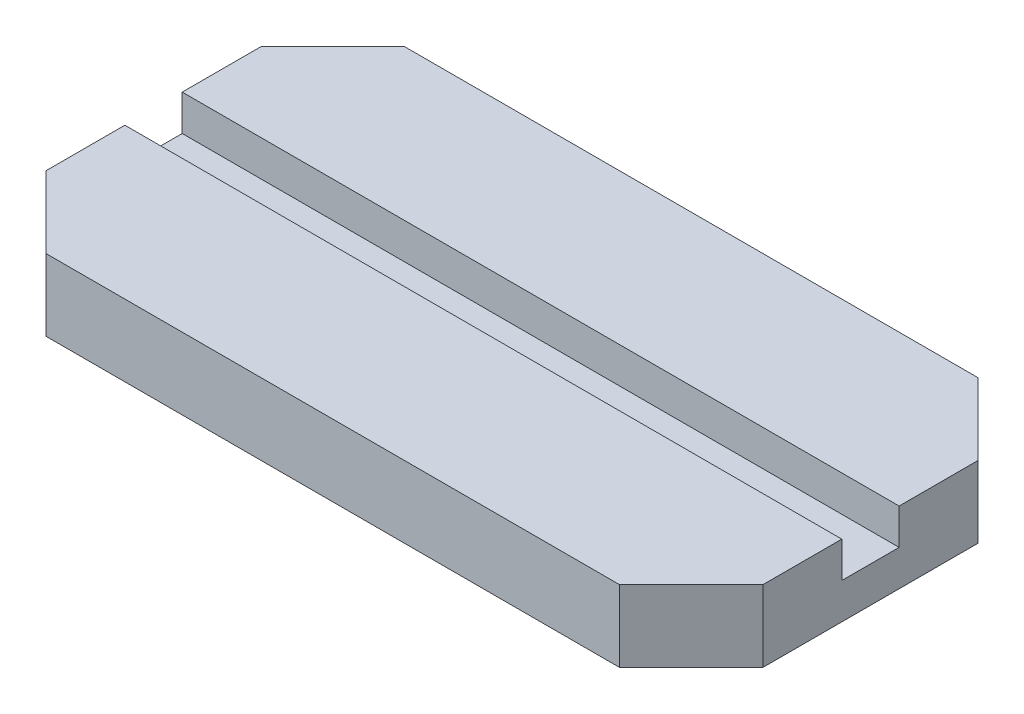
ISO-10303-21;
HEADER;
FILE_DESCRIPTION(('STEP AP214'),'2;1');
FILE_NAME('part.step','',(''),(''),'','','');
FILE_SCHEMA(('AUTOMOTIVE_DESIGN { 1 0 10303 214 1 1 1 1 }'));
ENDSEC;
DATA;
#1=APPLICATION_CONTEXT('core data for automotive mechanical design processes');
#2=APPLICATION_PROTOCOL_DEFINITION('international standard','automotive_design',2000,#1);
#3=PRODUCT_CONTEXT('',#1,'mechanical');
#4=PRODUCT('Part','Part','',(#3));
#5=PRODUCT_RELATED_PRODUCT_CATEGORY('part','',(#4));
#6=PRODUCT_DEFINITION_FORMATION('','',#4);
#7=PRODUCT_DEFINITION_CONTEXT('part definition',#1,'design');
#8=PRODUCT_DEFINITION('design','',#6,#7);
#9=PRODUCT_DEFINITION_SHAPE('','',#8);
#10=(LENGTH_UNIT() NAMED_UNIT(*) SI_UNIT(.MILLI.,.METRE.));
#11=(NAMED_UNIT(*) PLANE_ANGLE_UNIT() SI_UNIT($,.RADIAN.));
#12=(NAMED_UNIT(*) SI_UNIT($,.STERADIAN.) SOLID_ANGLE_UNIT());
#13=UNCERTAINTY_MEASURE_WITH_UNIT(LENGTH_MEASURE(1.E-05),#10,'distance_accuracy_value','');
#14=(GEOMETRIC_REPRESENTATION_CONTEXT(3) GLOBAL_UNCERTAINTY_ASSIGNED_CONTEXT((#13)) GLOBAL_UNIT_ASSIGNED_CONTEXT((#10,
#11,#12)) REPRESENTATION_CONTEXT('',''));
#15=CARTESIAN_POINT('',(0.,0.,0.));
#16=DIRECTION('',(0.,0.,1.));
#17=DIRECTION('',(1.,0.,0.));
#18=AXIS2_PLACEMENT_3D('',#15,#16,#17);
#19=CARTESIAN_POINT('',(0.,10.,0.));
#20=DIRECTION('',(0.,1.,0.));
#21=DIRECTION('',(0.,0.,1.));
#22=AXIS2_PLACEMENT_3D('',#19,#20,#21);
#23=PLANE('',#22);
#24=DIRECTION('',(-1.,0.,0.));
#25=VECTOR('',#24,1.);
#26=CARTESIAN_POINT('',(0.,10.,-4.));
#27=LINE('',#26,#25);
#28=CARTESIAN_POINT('',(50.,10.,-4.));
#29=VERTEX_POINT('',#28);
#30=CARTESIAN_POINT('',(-50.,10.,-4.));
#31=VERTEX_POINT('',#30);
#32=EDGE_CURVE('E55',#29,#31,#27,.T.);
#33=ORIENTED_EDGE('',*,*,#32,.F.);
#34=DIRECTION('',(0.,0.,-1.));
#35=VECTOR('',#34,1.);
#36=CARTESIAN_POINT('',(50.,10.,-25.));
#37=LINE('',#36,#35);
#38=CARTESIAN_POINT('',(50.,10.,-15.));
#39=VERTEX_POINT('',#38);
#40=EDGE_CURVE('E70',#29,#39,#37,.T.);
#41=ORIENTED_EDGE('',*,*,#40,.T.);
#42=DIRECTION('',(0.707106781186547,0.,0.707106781186549));
#43=VECTOR('',#42,1.);
#44=CARTESIAN_POINT('',(32.5,10.,-32.5));
#45=LINE('',#44,#43);
#46=CARTESIAN_POINT('',(40.,10.,-25.));
#47=VERTEX_POINT('',#46);
#48=EDGE_CURVE('E218',#39,#47,#45,.F.);
#49=ORIENTED_EDGE('',*,*,#48,.T.);
#50=DIRECTION('',(-1.,0.,0.));
#51=VECTOR('',#50,1.);
#52=CARTESIAN_POINT('',(-50.,10.,-25.));
#53=LINE('',#52,#51);
#54=CARTESIAN_POINT('',(-40.,10.,-25.));
#55=VERTEX_POINT('',#54);
#56=EDGE_CURVE('E161',#47,#55,#53,.T.);
#57=ORIENTED_EDGE('',*,*,#56,.T.);
#58=DIRECTION('',(0.707106781186549,0.,-0.707106781186547));
#59=VECTOR('',#58,1.);
#60=CARTESIAN_POINT('',(-32.4999999999999,10.,-32.5));
#61=LINE('',#60,#59);
#62=CARTESIAN_POINT('',(-50.,10.,-15.));
#63=VERTEX_POINT('',#62);
#64=EDGE_CURVE('E224',#55,#63,#61,.F.);
#65=ORIENTED_EDGE('',*,*,#64,.T.);
#66=DIRECTION('',(0.,0.,1.));
#67=VECTOR('',#66,1.);
#68=CARTESIAN_POINT('',(-50.,10.,-25.));
#69=LINE('',#68,#67);
#70=EDGE_CURVE('E251',#63,#31,#69,.T.);
#71=ORIENTED_EDGE('',*,*,#70,.T.);
#72=EDGE_LOOP('',(#33,#41,#49,#57,#65,#71));
#73=FACE_BOUND('',#72,.T.);
#74=ADVANCED_FACE('F45',(#73),#23,.T.);
#75=CARTESIAN_POINT('',(-50.,10.,-25.));
#76=DIRECTION('',(1.,0.,0.));
#77=DIRECTION('',(0.,0.,-1.));
#78=AXIS2_PLACEMENT_3D('',#75,#76,#77);
#79=PLANE('',#78);
#80=DIRECTION('',(0.,0.,1.));
#81=VECTOR('',#80,1.);
#82=CARTESIAN_POINT('',(-50.,5.,-25.));
#83=LINE('',#82,#81);
#84=CARTESIAN_POINT('',(-50.,5.,-4.));
#85=VERTEX_POINT('',#84);
#86=CARTESIAN_POINT('',(-50.,5.,4.));
#87=VERTEX_POINT('',#86);
#88=EDGE_CURVE('E177',#85,#87,#83,.T.);
#89=ORIENTED_EDGE('',*,*,#88,.F.);
#90=DIRECTION('',(0.,1.,0.));
#91=VECTOR('',#90,1.);
#92=CARTESIAN_POINT('',(-50.,10.,-4.));
#93=LINE('',#92,#91);
#94=EDGE_CURVE('E243',#85,#31,#93,.T.);
#95=ORIENTED_EDGE('',*,*,#94,.T.);
#96=ORIENTED_EDGE('',*,*,#70,.F.);
#97=DIRECTION('',(0.,-1.,0.));
#98=VECTOR('',#97,1.);
#99=CARTESIAN_POINT('',(-50.,10.,-15.));
#100=LINE('',#99,#98);
#101=CARTESIAN_POINT('',(-50.,0.,-15.));
#102=VERTEX_POINT('',#101);
#103=EDGE_CURVE('E193',#63,#102,#100,.T.);
#104=ORIENTED_EDGE('',*,*,#103,.T.);
#105=DIRECTION('',(0.,0.,1.));
#106=VECTOR('',#105,1.);
#107=CARTESIAN_POINT('',(-50.,0.,-25.));
#108=LINE('',#107,#106);
#109=CARTESIAN_POINT('',(-50.,0.,15.));
#110=VERTEX_POINT('',#109);
#111=EDGE_CURVE('E172',#102,#110,#108,.T.);
#112=ORIENTED_EDGE('',*,*,#111,.T.);
#113=DIRECTION('',(0.,1.,0.));
#114=VECTOR('',#113,1.);
#115=CARTESIAN_POINT('',(-50.,10.,15.));
#116=LINE('',#115,#114);
#117=CARTESIAN_POINT('',(-50.,10.,15.));
#118=VERTEX_POINT('',#117);
#119=EDGE_CURVE('E166',#110,#118,#116,.T.);
#120=ORIENTED_EDGE('',*,*,#119,.T.);
#121=CARTESIAN_POINT('',(-50.,10.,4.));
#122=VERTEX_POINT('',#121);
#123=EDGE_CURVE('E189',#122,#118,#69,.T.);
#124=ORIENTED_EDGE('',*,*,#123,.F.);
#125=DIRECTION('',(0.,-1.,0.));
#126=VECTOR('',#125,1.);
#127=CARTESIAN_POINT('',(-50.,10.,4.));
#128=LINE('',#127,#126);
#129=EDGE_CURVE('E62',#122,#87,#128,.T.);
#130=ORIENTED_EDGE('',*,*,#129,.T.);
#131=EDGE_LOOP('',(#89,#95,#96,#104,#112,#120,#124,#130));
#132=FACE_BOUND('',#131,.T.);
#133=ADVANCED_FACE('F250',(#132),#79,.F.);
#134=CARTESIAN_POINT('',(-50.,10.,25.));
#135=DIRECTION('',(0.,0.,-1.));
#136=DIRECTION('',(-1.,0.,0.));
#137=AXIS2_PLACEMENT_3D('',#134,#135,#136);
#138=PLANE('',#137);
#139=DIRECTION('',(1.,0.,0.));
#140=VECTOR('',#139,1.);
#141=CARTESIAN_POINT('',(-50.,10.,25.));
#142=LINE('',#141,#140);
#143=CARTESIAN_POINT('',(-40.,10.,25.));
#144=VERTEX_POINT('',#143);
#145=CARTESIAN_POINT('',(39.9999999999999,10.,25.));
#146=VERTEX_POINT('',#145);
#147=EDGE_CURVE('E168',#144,#146,#142,.T.);
#148=ORIENTED_EDGE('',*,*,#147,.F.);
#149=DIRECTION('',(0.,-1.,0.));
#150=VECTOR('',#149,1.);
#151=CARTESIAN_POINT('',(-40.,10.,25.));
#152=LINE('',#151,#150);
#153=CARTESIAN_POINT('',(-40.,0.,25.));
#154=VERTEX_POINT('',#153);
#155=EDGE_CURVE('E230',#144,#154,#152,.T.);
#156=ORIENTED_EDGE('',*,*,#155,.T.);
#157=DIRECTION('',(1.,0.,0.));
#158=VECTOR('',#157,1.);
#159=CARTESIAN_POINT('',(-50.,0.,25.));
#160=LINE('',#159,#158);
#161=CARTESIAN_POINT('',(39.9999999999999,0.,25.));
#162=VERTEX_POINT('',#161);
#163=EDGE_CURVE('E176',#154,#162,#160,.T.);
#164=ORIENTED_EDGE('',*,*,#163,.T.);
#165=DIRECTION('',(0.,1.,0.));
#166=VECTOR('',#165,1.);
#167=CARTESIAN_POINT('',(39.9999999999999,10.,25.));
#168=LINE('',#167,#166);
#169=EDGE_CURVE('E227',#162,#146,#168,.T.);
#170=ORIENTED_EDGE('',*,*,#169,.T.);
#171=EDGE_LOOP('',(#148,#156,#164,#170));
#172=FACE_BOUND('',#171,.T.);
#173=ADVANCED_FACE('F278',(#172),#138,.F.);
#174=CARTESIAN_POINT('',(50.,10.,-25.));
#175=DIRECTION('',(-1.,0.,0.));
#176=DIRECTION('',(0.,0.,1.));
#177=AXIS2_PLACEMENT_3D('',#174,#175,#176);
#178=PLANE('',#177);
#179=ORIENTED_EDGE('',*,*,#40,.F.);
#180=DIRECTION('',(0.,-1.,0.));
#181=VECTOR('',#180,1.);
#182=CARTESIAN_POINT('',(50.,10.,-4.));
#183=LINE('',#182,#181);
#184=CARTESIAN_POINT('',(50.,5.,-4.));
#185=VERTEX_POINT('',#184);
#186=EDGE_CURVE('E245',#29,#185,#183,.T.);
#187=ORIENTED_EDGE('',*,*,#186,.T.);
#188=DIRECTION('',(0.,0.,-1.));
#189=VECTOR('',#188,1.);
#190=CARTESIAN_POINT('',(50.,5.,-25.));
#191=LINE('',#190,#189);
#192=CARTESIAN_POINT('',(50.,5.,4.));
#193=VERTEX_POINT('',#192);
#194=EDGE_CURVE('E11',#193,#185,#191,.T.);
#195=ORIENTED_EDGE('',*,*,#194,.F.);
#196=DIRECTION('',(0.,1.,0.));
#197=VECTOR('',#196,1.);
#198=CARTESIAN_POINT('',(50.,10.,4.));
#199=LINE('',#198,#197);
#200=CARTESIAN_POINT('',(50.,10.,4.));
#201=VERTEX_POINT('',#200);
#202=EDGE_CURVE('E137',#193,#201,#199,.T.);
#203=ORIENTED_EDGE('',*,*,#202,.T.);
#204=CARTESIAN_POINT('',(50.,10.,15.));
#205=VERTEX_POINT('',#204);
#206=EDGE_CURVE('E150',#205,#201,#37,.T.);
#207=ORIENTED_EDGE('',*,*,#206,.F.);
#208=DIRECTION('',(0.,-1.,0.));
#209=VECTOR('',#208,1.);
#210=CARTESIAN_POINT('',(50.,10.,15.));
#211=LINE('',#210,#209);
#212=CARTESIAN_POINT('',(50.,0.,15.));
#213=VERTEX_POINT('',#212);
#214=EDGE_CURVE('E234',#205,#213,#211,.T.);
#215=ORIENTED_EDGE('',*,*,#214,.T.);
#216=DIRECTION('',(0.,0.,-1.));
#217=VECTOR('',#216,1.);
#218=CARTESIAN_POINT('',(50.,0.,-25.));
#219=LINE('',#218,#217);
#220=CARTESIAN_POINT('',(50.,0.,-15.));
#221=VERTEX_POINT('',#220);
#222=EDGE_CURVE('E181',#213,#221,#219,.T.);
#223=ORIENTED_EDGE('',*,*,#222,.T.);
#224=DIRECTION('',(0.,1.,0.));
#225=VECTOR('',#224,1.);
#226=CARTESIAN_POINT('',(50.,10.,-15.));
#227=LINE('',#226,#225);
#228=EDGE_CURVE('E143',#221,#39,#227,.T.);
#229=ORIENTED_EDGE('',*,*,#228,.T.);
#230=EDGE_LOOP('',(#179,#187,#195,#203,#207,#215,#223,#229));
#231=FACE_BOUND('',#230,.T.);
#232=ADVANCED_FACE('F148',(#231),#178,.F.);
#233=CARTESIAN_POINT('',(-50.,10.,-25.));
#234=DIRECTION('',(0.,0.,1.));
#235=DIRECTION('',(1.,0.,0.));
#236=AXIS2_PLACEMENT_3D('',#233,#234,#235);
#237=PLANE('',#236);
#238=DIRECTION('',(-1.,0.,0.));
#239=VECTOR('',#238,1.);
#240=CARTESIAN_POINT('',(-50.,0.,-25.));
#241=LINE('',#240,#239);
#242=CARTESIAN_POINT('',(40.,0.,-25.));
#243=VERTEX_POINT('',#242);
#244=CARTESIAN_POINT('',(-40.,0.,-25.));
#245=VERTEX_POINT('',#244);
#246=EDGE_CURVE('E185',#243,#245,#241,.T.);
#247=ORIENTED_EDGE('',*,*,#246,.T.);
#248=DIRECTION('',(0.,1.,0.));
#249=VECTOR('',#248,1.);
#250=CARTESIAN_POINT('',(-40.,10.,-25.));
#251=LINE('',#250,#249);
#252=EDGE_CURVE('E213',#245,#55,#251,.T.);
#253=ORIENTED_EDGE('',*,*,#252,.T.);
#254=ORIENTED_EDGE('',*,*,#56,.F.);
#255=DIRECTION('',(0.,-1.,0.));
#256=VECTOR('',#255,1.);
#257=CARTESIAN_POINT('',(40.,10.,-25.));
#258=LINE('',#257,#256);
#259=EDGE_CURVE('E209',#47,#243,#258,.T.);
#260=ORIENTED_EDGE('',*,*,#259,.T.);
#261=EDGE_LOOP('',(#247,#253,#254,#260));
#262=FACE_BOUND('',#261,.T.);
#263=ADVANCED_FACE('F290',(#262),#237,.F.);
#264=DIRECTION('',(1.,0.,0.));
#265=VECTOR('',#264,1.);
#266=CARTESIAN_POINT('',(0.,10.,4.));
#267=LINE('',#266,#265);
#268=EDGE_CURVE('E134',#122,#201,#267,.T.);
#269=ORIENTED_EDGE('',*,*,#268,.F.);
#270=ORIENTED_EDGE('',*,*,#123,.T.);
#271=DIRECTION('',(-0.707106781186546,0.,-0.707106781186549));
#272=VECTOR('',#271,1.);
#273=CARTESIAN_POINT('',(-32.5000000000001,10.,32.5));
#274=LINE('',#273,#272);
#275=EDGE_CURVE('E221',#118,#144,#274,.F.);
#276=ORIENTED_EDGE('',*,*,#275,.T.);
#277=ORIENTED_EDGE('',*,*,#147,.T.);
#278=DIRECTION('',(-0.707106781186549,0.,0.707106781186546));
#279=VECTOR('',#278,1.);
#280=CARTESIAN_POINT('',(32.4999999999999,10.,32.5));
#281=LINE('',#280,#279);
#282=EDGE_CURVE('E159',#146,#205,#281,.F.);
#283=ORIENTED_EDGE('',*,*,#282,.T.);
#284=ORIENTED_EDGE('',*,*,#206,.T.);
#285=EDGE_LOOP('',(#269,#270,#276,#277,#283,#284));
#286=FACE_BOUND('',#285,.T.);
#287=ADVANCED_FACE('F156',(#286),#23,.T.);
#288=CARTESIAN_POINT('',(0.,0.,0.));
#289=DIRECTION('',(0.,1.,0.));
#290=DIRECTION('',(0.,0.,1.));
#291=AXIS2_PLACEMENT_3D('',#288,#289,#290);
#292=PLANE('',#291);
#293=ORIENTED_EDGE('',*,*,#111,.F.);
#294=DIRECTION('',(-0.707106781186549,0.,0.707106781186547));
#295=VECTOR('',#294,1.);
#296=CARTESIAN_POINT('',(-50.,0.,-15.));
#297=LINE('',#296,#295);
#298=EDGE_CURVE('E206',#102,#245,#297,.F.);
#299=ORIENTED_EDGE('',*,*,#298,.T.);
#300=ORIENTED_EDGE('',*,*,#246,.F.);
#301=DIRECTION('',(-0.707106781186547,0.,-0.707106781186549));
#302=VECTOR('',#301,1.);
#303=CARTESIAN_POINT('',(40.,0.,-25.));
#304=LINE('',#303,#302);
#305=EDGE_CURVE('E200',#243,#221,#304,.F.);
#306=ORIENTED_EDGE('',*,*,#305,.T.);
#307=ORIENTED_EDGE('',*,*,#222,.F.);
#308=DIRECTION('',(0.707106781186549,0.,-0.707106781186546));
#309=VECTOR('',#308,1.);
#310=CARTESIAN_POINT('',(50.,0.,15.));
#311=LINE('',#310,#309);
#312=EDGE_CURVE('E197',#213,#162,#311,.F.);
#313=ORIENTED_EDGE('',*,*,#312,.T.);
#314=ORIENTED_EDGE('',*,*,#163,.F.);
#315=DIRECTION('',(0.707106781186546,0.,0.707106781186549));
#316=VECTOR('',#315,1.);
#317=CARTESIAN_POINT('',(-40.,0.,25.));
#318=LINE('',#317,#316);
#319=EDGE_CURVE('E203',#154,#110,#318,.F.);
#320=ORIENTED_EDGE('',*,*,#319,.T.);
#321=EDGE_LOOP('',(#293,#299,#300,#306,#307,#313,#314,#320));
#322=FACE_BOUND('',#321,.T.);
#323=ADVANCED_FACE('F284',(#322),#292,.F.);
#324=CARTESIAN_POINT('',(-50.,10.,-15.));
#325=DIRECTION('',(0.707106781186547,0.,0.707106781186549));
#326=DIRECTION('',(0.,-1.,0.));
#327=AXIS2_PLACEMENT_3D('',#324,#325,#326);
#328=PLANE('',#327);
#329=ORIENTED_EDGE('',*,*,#64,.F.);
#330=ORIENTED_EDGE('',*,*,#252,.F.);
#331=ORIENTED_EDGE('',*,*,#298,.F.);
#332=ORIENTED_EDGE('',*,*,#103,.F.);
#333=EDGE_LOOP('',(#329,#330,#331,#332));
#334=FACE_BOUND('',#333,.T.);
#335=ADVANCED_FACE('F286',(#334),#328,.F.);
#336=CARTESIAN_POINT('',(-40.,10.,25.));
#337=DIRECTION('',(0.707106781186549,0.,-0.707106781186546));
#338=DIRECTION('',(0.,-1.,0.));
#339=AXIS2_PLACEMENT_3D('',#336,#337,#338);
#340=PLANE('',#339);
#341=ORIENTED_EDGE('',*,*,#275,.F.);
#342=ORIENTED_EDGE('',*,*,#119,.F.);
#343=ORIENTED_EDGE('',*,*,#319,.F.);
#344=ORIENTED_EDGE('',*,*,#155,.F.);
#345=EDGE_LOOP('',(#341,#342,#343,#344));
#346=FACE_BOUND('',#345,.T.);
#347=ADVANCED_FACE('F281',(#346),#340,.F.);
#348=CARTESIAN_POINT('',(40.,10.,-25.));
#349=DIRECTION('',(-0.707106781186549,0.,0.707106781186547));
#350=DIRECTION('',(0.,-1.,0.));
#351=AXIS2_PLACEMENT_3D('',#348,#349,#350);
#352=PLANE('',#351);
#353=ORIENTED_EDGE('',*,*,#48,.F.);
#354=ORIENTED_EDGE('',*,*,#228,.F.);
#355=ORIENTED_EDGE('',*,*,#305,.F.);
#356=ORIENTED_EDGE('',*,*,#259,.F.);
#357=EDGE_LOOP('',(#353,#354,#355,#356));
#358=FACE_BOUND('',#357,.T.);
#359=ADVANCED_FACE('F295',(#358),#352,.F.);
#360=CARTESIAN_POINT('',(50.,10.,15.));
#361=DIRECTION('',(-0.707106781186546,0.,-0.707106781186549));
#362=DIRECTION('',(0.,-1.,0.));
#363=AXIS2_PLACEMENT_3D('',#360,#361,#362);
#364=PLANE('',#363);
#365=ORIENTED_EDGE('',*,*,#282,.F.);
#366=ORIENTED_EDGE('',*,*,#169,.F.);
#367=ORIENTED_EDGE('',*,*,#312,.F.);
#368=ORIENTED_EDGE('',*,*,#214,.F.);
#369=EDGE_LOOP('',(#365,#366,#367,#368));
#370=FACE_BOUND('',#369,.T.);
#371=ADVANCED_FACE('F48',(#370),#364,.F.);
#372=CARTESIAN_POINT('',(0.,5.,0.));
#373=DIRECTION('',(0.,1.,0.));
#374=DIRECTION('',(0.,0.,1.));
#375=AXIS2_PLACEMENT_3D('',#372,#373,#374);
#376=PLANE('',#375);
#377=ORIENTED_EDGE('',*,*,#88,.T.);
#378=DIRECTION('',(1.,0.,0.));
#379=VECTOR('',#378,1.);
#380=CARTESIAN_POINT('',(-58.3808225040527,5.,4.));
#381=LINE('',#380,#379);
#382=EDGE_CURVE('E268',#87,#193,#381,.T.);
#383=ORIENTED_EDGE('',*,*,#382,.T.);
#384=ORIENTED_EDGE('',*,*,#194,.T.);
#385=DIRECTION('',(-1.,0.,0.));
#386=VECTOR('',#385,1.);
#387=CARTESIAN_POINT('',(-58.3808225040527,5.,-4.));
#388=LINE('',#387,#386);
#389=EDGE_CURVE('E154',#185,#85,#388,.T.);
#390=ORIENTED_EDGE('',*,*,#389,.T.);
#391=EDGE_LOOP('',(#377,#383,#384,#390));
#392=FACE_BOUND('',#391,.T.);
#393=ADVANCED_FACE('F271',(#392),#376,.T.);
#394=CARTESIAN_POINT('',(-58.3808225040527,5.,-4.));
#395=DIRECTION('',(0.,0.,-1.));
#396=DIRECTION('',(-1.,0.,0.));
#397=AXIS2_PLACEMENT_3D('',#394,#395,#396);
#398=PLANE('',#397);
#399=ORIENTED_EDGE('',*,*,#389,.F.);
#400=ORIENTED_EDGE('',*,*,#186,.F.);
#401=ORIENTED_EDGE('',*,*,#32,.T.);
#402=ORIENTED_EDGE('',*,*,#94,.F.);
#403=EDGE_LOOP('',(#399,#400,#401,#402));
#404=FACE_BOUND('',#403,.T.);
#405=ADVANCED_FACE('F242',(#404),#398,.F.);
#406=CARTESIAN_POINT('',(-58.3808225040527,5.,4.));
#407=DIRECTION('',(0.,0.,1.));
#408=DIRECTION('',(1.,0.,0.));
#409=AXIS2_PLACEMENT_3D('',#406,#407,#408);
#410=PLANE('',#409);
#411=ORIENTED_EDGE('',*,*,#268,.T.);
#412=ORIENTED_EDGE('',*,*,#202,.F.);
#413=ORIENTED_EDGE('',*,*,#382,.F.);
#414=ORIENTED_EDGE('',*,*,#129,.F.);
#415=EDGE_LOOP('',(#411,#412,#413,#414));
#416=FACE_BOUND('',#415,.T.);
#417=ADVANCED_FACE('F136',(#416),#410,.F.);
#418=CLOSED_SHELL('',(#74,#133,#173,#232,#263,#287,#323,#335,#347,#359,#371,#393,#405,#417));
#419=MANIFOLD_SOLID_BREP('B2',#418);
#420=ADVANCED_BREP_SHAPE_REPRESENTATION('',(#18,#419),#14);
#421=SHAPE_DEFINITION_REPRESENTATION(#9,#420);
ENDSEC;
END-ISO-10303-21;
